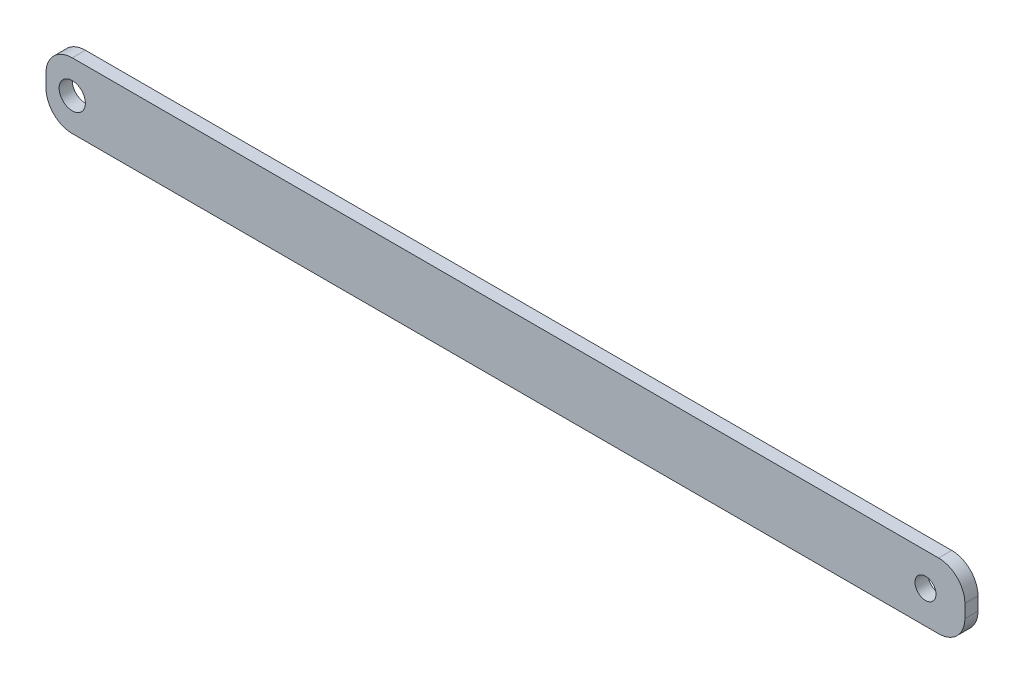
ISO-10303-21;
HEADER;
FILE_DESCRIPTION(('STEP AP214'),'2;1');
FILE_NAME('part.step','',(''),(''),'','','');
FILE_SCHEMA(('AUTOMOTIVE_DESIGN { 1 0 10303 214 1 1 1 1 }'));
ENDSEC;
DATA;
#1=APPLICATION_CONTEXT('core data for automotive mechanical design processes');
#2=APPLICATION_PROTOCOL_DEFINITION('international standard','automotive_design',2000,#1);
#3=PRODUCT_CONTEXT('',#1,'mechanical');
#4=PRODUCT('Part','Part','',(#3));
#5=PRODUCT_RELATED_PRODUCT_CATEGORY('part','',(#4));
#6=PRODUCT_DEFINITION_FORMATION('','',#4);
#7=PRODUCT_DEFINITION_CONTEXT('part definition',#1,'design');
#8=PRODUCT_DEFINITION('design','',#6,#7);
#9=PRODUCT_DEFINITION_SHAPE('','',#8);
#10=(LENGTH_UNIT() NAMED_UNIT(*) SI_UNIT(.MILLI.,.METRE.));
#11=(NAMED_UNIT(*) PLANE_ANGLE_UNIT() SI_UNIT($,.RADIAN.));
#12=(NAMED_UNIT(*) SI_UNIT($,.STERADIAN.) SOLID_ANGLE_UNIT());
#13=UNCERTAINTY_MEASURE_WITH_UNIT(LENGTH_MEASURE(1.E-05),#10,'distance_accuracy_value','');
#14=(GEOMETRIC_REPRESENTATION_CONTEXT(3) GLOBAL_UNCERTAINTY_ASSIGNED_CONTEXT((#13)) GLOBAL_UNIT_ASSIGNED_CONTEXT((#10,
#11,#12)) REPRESENTATION_CONTEXT('',''));
#15=CARTESIAN_POINT('',(0.,0.,0.));
#16=DIRECTION('',(0.,0.,1.));
#17=DIRECTION('',(1.,0.,0.));
#18=AXIS2_PLACEMENT_3D('',#15,#16,#17);
#19=CARTESIAN_POINT('',(15.,-12.5,2.5));
#20=DIRECTION('',(-1.,0.,0.));
#21=DIRECTION('',(0.,1.,0.));
#22=AXIS2_PLACEMENT_3D('',#19,#20,#21);
#23=PLANE('',#22);
#24=DIRECTION('',(0.,0.,1.));
#25=VECTOR('',#24,1.);
#26=CARTESIAN_POINT('',(15.,-2.5,2.5));
#27=LINE('',#26,#25);
#28=CARTESIAN_POINT('',(15.,-2.5,-2.5));
#29=VERTEX_POINT('',#28);
#30=CARTESIAN_POINT('',(15.,-2.5,2.5));
#31=VERTEX_POINT('',#30);
#32=EDGE_CURVE('E11',#29,#31,#27,.T.);
#33=ORIENTED_EDGE('',*,*,#32,.F.);
#34=DIRECTION('',(0.,1.,0.));
#35=VECTOR('',#34,1.);
#36=CARTESIAN_POINT('',(15.,-12.5,-2.5));
#37=LINE('',#36,#35);
#38=CARTESIAN_POINT('',(15.,2.5,-2.5));
#39=VERTEX_POINT('',#38);
#40=EDGE_CURVE('E103',#29,#39,#37,.T.);
#41=ORIENTED_EDGE('',*,*,#40,.T.);
#42=DIRECTION('',(0.,0.,1.));
#43=VECTOR('',#42,1.);
#44=CARTESIAN_POINT('',(15.,2.5,2.5));
#45=LINE('',#44,#43);
#46=CARTESIAN_POINT('',(15.,2.5,2.5));
#47=VERTEX_POINT('',#46);
#48=EDGE_CURVE('E46',#39,#47,#45,.T.);
#49=ORIENTED_EDGE('',*,*,#48,.T.);
#50=DIRECTION('',(0.,1.,0.));
#51=VECTOR('',#50,1.);
#52=CARTESIAN_POINT('',(15.,-12.5,2.5));
#53=LINE('',#52,#51);
#54=EDGE_CURVE('E145',#31,#47,#53,.T.);
#55=ORIENTED_EDGE('',*,*,#54,.F.);
#56=EDGE_LOOP('',(#33,#41,#49,#55));
#57=FACE_BOUND('',#56,.T.);
#58=ADVANCED_FACE('F36',(#57),#23,.F.);
#59=CARTESIAN_POINT('',(5.,2.5,2.5));
#60=DIRECTION('',(0.,0.,-1.));
#61=DIRECTION('',(-1.,0.,0.));
#62=AXIS2_PLACEMENT_3D('',#59,#60,#61);
#63=CYLINDRICAL_SURFACE('',#62,10.);
#64=ORIENTED_EDGE('',*,*,#48,.F.);
#65=CARTESIAN_POINT('',(5.,2.5,-2.5));
#66=DIRECTION('',(0.,0.,-1.));
#67=DIRECTION('',(-1.,0.,0.));
#68=AXIS2_PLACEMENT_3D('',#65,#66,#67);
#69=CIRCLE('',#68,10.);
#70=CARTESIAN_POINT('',(5.,12.5,-2.5));
#71=VERTEX_POINT('',#70);
#72=EDGE_CURVE('E125',#39,#71,#69,.F.);
#73=ORIENTED_EDGE('',*,*,#72,.T.);
#74=DIRECTION('',(0.,0.,1.));
#75=VECTOR('',#74,1.);
#76=CARTESIAN_POINT('',(5.,12.5,2.5));
#77=LINE('',#76,#75);
#78=CARTESIAN_POINT('',(5.,12.5,2.5));
#79=VERTEX_POINT('',#78);
#80=EDGE_CURVE('E138',#71,#79,#77,.T.);
#81=ORIENTED_EDGE('',*,*,#80,.T.);
#82=CARTESIAN_POINT('',(5.,2.5,2.5));
#83=DIRECTION('',(0.,0.,-1.));
#84=DIRECTION('',(-1.,0.,0.));
#85=AXIS2_PLACEMENT_3D('',#82,#83,#84);
#86=CIRCLE('',#85,10.);
#87=EDGE_CURVE('E154',#47,#79,#86,.F.);
#88=ORIENTED_EDGE('',*,*,#87,.F.);
#89=EDGE_LOOP('',(#64,#73,#81,#88));
#90=FACE_BOUND('',#89,.T.);
#91=ADVANCED_FACE('F157',(#90),#63,.T.);
#92=CARTESIAN_POINT('',(-335.,12.5,2.50000000000004));
#93=DIRECTION('',(0.,1.,0.));
#94=DIRECTION('',(1.,0.,0.));
#95=AXIS2_PLACEMENT_3D('',#92,#93,#94);
#96=PLANE('',#95);
#97=ORIENTED_EDGE('',*,*,#80,.F.);
#98=DIRECTION('',(-1.,0.,0.));
#99=VECTOR('',#98,1.);
#100=CARTESIAN_POINT('',(-335.,12.5,-2.49999999999996));
#101=LINE('',#100,#99);
#102=CARTESIAN_POINT('',(-325.,12.5,-2.49999999999996));
#103=VERTEX_POINT('',#102);
#104=EDGE_CURVE('E122',#103,#71,#101,.F.);
#105=ORIENTED_EDGE('',*,*,#104,.F.);
#106=DIRECTION('',(0.,0.,1.));
#107=VECTOR('',#106,1.);
#108=CARTESIAN_POINT('',(-325.,12.5,2.50000000000004));
#109=LINE('',#108,#107);
#110=CARTESIAN_POINT('',(-325.,12.5,2.50000000000004));
#111=VERTEX_POINT('',#110);
#112=EDGE_CURVE('E135',#103,#111,#109,.T.);
#113=ORIENTED_EDGE('',*,*,#112,.T.);
#114=DIRECTION('',(1.,0.,0.));
#115=VECTOR('',#114,1.);
#116=CARTESIAN_POINT('',(-335.,12.5,2.50000000000004));
#117=LINE('',#116,#115);
#118=EDGE_CURVE('E158',#111,#79,#117,.T.);
#119=ORIENTED_EDGE('',*,*,#118,.T.);
#120=EDGE_LOOP('',(#97,#105,#113,#119));
#121=FACE_BOUND('',#120,.T.);
#122=ADVANCED_FACE('F196',(#121),#96,.T.);
#123=CARTESIAN_POINT('',(-325.,2.5,2.50000000000004));
#124=DIRECTION('',(0.,0.,-1.));
#125=DIRECTION('',(-1.,0.,0.));
#126=AXIS2_PLACEMENT_3D('',#123,#124,#125);
#127=CYLINDRICAL_SURFACE('',#126,10.);
#128=ORIENTED_EDGE('',*,*,#112,.F.);
#129=CARTESIAN_POINT('',(-325.,2.5,-2.49999999999996));
#130=DIRECTION('',(0.,0.,-1.));
#131=DIRECTION('',(-1.,0.,0.));
#132=AXIS2_PLACEMENT_3D('',#129,#130,#131);
#133=CIRCLE('',#132,10.);
#134=CARTESIAN_POINT('',(-335.,2.5,-2.49999999999996));
#135=VERTEX_POINT('',#134);
#136=EDGE_CURVE('E119',#103,#135,#133,.F.);
#137=ORIENTED_EDGE('',*,*,#136,.T.);
#138=DIRECTION('',(0.,0.,1.));
#139=VECTOR('',#138,1.);
#140=CARTESIAN_POINT('',(-335.,2.5,2.50000000000004));
#141=LINE('',#140,#139);
#142=CARTESIAN_POINT('',(-335.,2.5,2.50000000000004));
#143=VERTEX_POINT('',#142);
#144=EDGE_CURVE('E132',#135,#143,#141,.T.);
#145=ORIENTED_EDGE('',*,*,#144,.T.);
#146=CARTESIAN_POINT('',(-325.,2.5,2.50000000000004));
#147=DIRECTION('',(0.,0.,-1.));
#148=DIRECTION('',(-1.,0.,0.));
#149=AXIS2_PLACEMENT_3D('',#146,#147,#148);
#150=CIRCLE('',#149,10.);
#151=EDGE_CURVE('E160',#111,#143,#150,.F.);
#152=ORIENTED_EDGE('',*,*,#151,.F.);
#153=EDGE_LOOP('',(#128,#137,#145,#152));
#154=FACE_BOUND('',#153,.T.);
#155=ADVANCED_FACE('F201',(#154),#127,.T.);
#156=CARTESIAN_POINT('',(-335.,-12.5,2.50000000000004));
#157=DIRECTION('',(-1.,0.,0.));
#158=DIRECTION('',(0.,1.,0.));
#159=AXIS2_PLACEMENT_3D('',#156,#157,#158);
#160=PLANE('',#159);
#161=ORIENTED_EDGE('',*,*,#144,.F.);
#162=DIRECTION('',(0.,1.,0.));
#163=VECTOR('',#162,1.);
#164=CARTESIAN_POINT('',(-335.,-12.5,-2.49999999999996));
#165=LINE('',#164,#163);
#166=CARTESIAN_POINT('',(-335.,-2.5,-2.49999999999996));
#167=VERTEX_POINT('',#166);
#168=EDGE_CURVE('E116',#167,#135,#165,.T.);
#169=ORIENTED_EDGE('',*,*,#168,.F.);
#170=DIRECTION('',(0.,0.,1.));
#171=VECTOR('',#170,1.);
#172=CARTESIAN_POINT('',(-335.,-2.5,2.50000000000004));
#173=LINE('',#172,#171);
#174=CARTESIAN_POINT('',(-335.,-2.5,2.50000000000004));
#175=VERTEX_POINT('',#174);
#176=EDGE_CURVE('E130',#167,#175,#173,.T.);
#177=ORIENTED_EDGE('',*,*,#176,.T.);
#178=DIRECTION('',(0.,1.,0.));
#179=VECTOR('',#178,1.);
#180=CARTESIAN_POINT('',(-335.,-12.5,2.50000000000004));
#181=LINE('',#180,#179);
#182=EDGE_CURVE('E166',#175,#143,#181,.T.);
#183=ORIENTED_EDGE('',*,*,#182,.T.);
#184=EDGE_LOOP('',(#161,#169,#177,#183));
#185=FACE_BOUND('',#184,.T.);
#186=ADVANCED_FACE('F205',(#185),#160,.T.);
#187=CARTESIAN_POINT('',(-325.,-2.5,2.50000000000004));
#188=DIRECTION('',(0.,0.,-1.));
#189=DIRECTION('',(-1.,0.,0.));
#190=AXIS2_PLACEMENT_3D('',#187,#188,#189);
#191=CYLINDRICAL_SURFACE('',#190,10.);
#192=ORIENTED_EDGE('',*,*,#176,.F.);
#193=CARTESIAN_POINT('',(-325.,-2.5,-2.49999999999996));
#194=DIRECTION('',(0.,0.,-1.));
#195=DIRECTION('',(-1.,0.,0.));
#196=AXIS2_PLACEMENT_3D('',#193,#194,#195);
#197=CIRCLE('',#196,10.);
#198=CARTESIAN_POINT('',(-325.,-12.5,-2.49999999999996));
#199=VERTEX_POINT('',#198);
#200=EDGE_CURVE('E113',#167,#199,#197,.F.);
#201=ORIENTED_EDGE('',*,*,#200,.T.);
#202=DIRECTION('',(0.,0.,1.));
#203=VECTOR('',#202,1.);
#204=CARTESIAN_POINT('',(-325.,-12.5,2.50000000000004));
#205=LINE('',#204,#203);
#206=CARTESIAN_POINT('',(-325.,-12.5,2.50000000000004));
#207=VERTEX_POINT('',#206);
#208=EDGE_CURVE('E54',#199,#207,#205,.T.);
#209=ORIENTED_EDGE('',*,*,#208,.T.);
#210=CARTESIAN_POINT('',(-325.,-2.5,2.50000000000004));
#211=DIRECTION('',(0.,0.,-1.));
#212=DIRECTION('',(-1.,0.,0.));
#213=AXIS2_PLACEMENT_3D('',#210,#211,#212);
#214=CIRCLE('',#213,10.);
#215=EDGE_CURVE('E96',#175,#207,#214,.F.);
#216=ORIENTED_EDGE('',*,*,#215,.F.);
#217=EDGE_LOOP('',(#192,#201,#209,#216));
#218=FACE_BOUND('',#217,.T.);
#219=ADVANCED_FACE('F209',(#218),#191,.T.);
#220=CARTESIAN_POINT('',(-335.,-12.5,2.50000000000004));
#221=DIRECTION('',(0.,1.,0.));
#222=DIRECTION('',(1.,0.,0.));
#223=AXIS2_PLACEMENT_3D('',#220,#221,#222);
#224=PLANE('',#223);
#225=ORIENTED_EDGE('',*,*,#208,.F.);
#226=DIRECTION('',(-1.,0.,0.));
#227=VECTOR('',#226,1.);
#228=CARTESIAN_POINT('',(-335.,-12.5,-2.49999999999996));
#229=LINE('',#228,#227);
#230=CARTESIAN_POINT('',(5.,-12.5,-2.5));
#231=VERTEX_POINT('',#230);
#232=EDGE_CURVE('E101',#199,#231,#229,.F.);
#233=ORIENTED_EDGE('',*,*,#232,.T.);
#234=DIRECTION('',(0.,0.,1.));
#235=VECTOR('',#234,1.);
#236=CARTESIAN_POINT('',(5.,-12.5,2.5));
#237=LINE('',#236,#235);
#238=CARTESIAN_POINT('',(5.,-12.5,2.5));
#239=VERTEX_POINT('',#238);
#240=EDGE_CURVE('E40',#231,#239,#237,.T.);
#241=ORIENTED_EDGE('',*,*,#240,.T.);
#242=DIRECTION('',(1.,0.,0.));
#243=VECTOR('',#242,1.);
#244=CARTESIAN_POINT('',(-335.,-12.5,2.50000000000004));
#245=LINE('',#244,#243);
#246=EDGE_CURVE('E343',#207,#239,#245,.T.);
#247=ORIENTED_EDGE('',*,*,#246,.F.);
#248=EDGE_LOOP('',(#225,#233,#241,#247));
#249=FACE_BOUND('',#248,.T.);
#250=ADVANCED_FACE('F105',(#249),#224,.F.);
#251=CARTESIAN_POINT('',(-325.,0.,2.50000000000004));
#252=DIRECTION('',(0.,0.,-1.));
#253=DIRECTION('',(-1.,0.,0.));
#254=AXIS2_PLACEMENT_3D('',#251,#252,#253);
#255=CYLINDRICAL_SURFACE('',#254,4.99999999999999);
#256=CARTESIAN_POINT('',(-325.,0.,2.50000000000004));
#257=DIRECTION('',(0.,0.,-1.));
#258=DIRECTION('',(-1.,0.,0.));
#259=AXIS2_PLACEMENT_3D('',#256,#257,#258);
#260=CIRCLE('',#259,4.99999999999999);
#261=CARTESIAN_POINT('',(-330.,0.,2.50000000000004));
#262=VERTEX_POINT('',#261);
#263=EDGE_CURVE('E115',#262,#262,#260,.T.);
#264=ORIENTED_EDGE('',*,*,#263,.F.);
#265=EDGE_LOOP('',(#264));
#266=FACE_BOUND('',#265,.T.);
#267=CARTESIAN_POINT('',(-325.,0.,-2.49999999999996));
#268=DIRECTION('',(0.,0.,-1.));
#269=DIRECTION('',(-1.,0.,0.));
#270=AXIS2_PLACEMENT_3D('',#267,#268,#269);
#271=CIRCLE('',#270,4.99999999999999);
#272=CARTESIAN_POINT('',(-330.,0.,-2.49999999999996));
#273=VERTEX_POINT('',#272);
#274=EDGE_CURVE('E109',#273,#273,#271,.T.);
#275=ORIENTED_EDGE('',*,*,#274,.T.);
#276=EDGE_LOOP('',(#275));
#277=FACE_BOUND('',#276,.T.);
#278=ADVANCED_FACE('F173',(#266,#277),#255,.F.);
#279=CARTESIAN_POINT('',(0.,0.,2.5));
#280=DIRECTION('',(0.,0.,-1.));
#281=DIRECTION('',(-1.,0.,0.));
#282=AXIS2_PLACEMENT_3D('',#279,#280,#281);
#283=CYLINDRICAL_SURFACE('',#282,4.);
#284=CARTESIAN_POINT('',(0.,0.,2.5));
#285=DIRECTION('',(0.,0.,1.));
#286=DIRECTION('',(1.,0.,0.));
#287=AXIS2_PLACEMENT_3D('',#284,#285,#286);
#288=CIRCLE('',#287,4.);
#289=CARTESIAN_POINT('',(4.,0.,2.5));
#290=VERTEX_POINT('',#289);
#291=EDGE_CURVE('E342',#290,#290,#288,.T.);
#292=ORIENTED_EDGE('',*,*,#291,.T.);
#293=EDGE_LOOP('',(#292));
#294=FACE_BOUND('',#293,.T.);
#295=CARTESIAN_POINT('',(0.,0.,-2.5));
#296=DIRECTION('',(0.,0.,1.));
#297=DIRECTION('',(1.,0.,0.));
#298=AXIS2_PLACEMENT_3D('',#295,#296,#297);
#299=CIRCLE('',#298,4.);
#300=CARTESIAN_POINT('',(4.,0.,-2.5));
#301=VERTEX_POINT('',#300);
#302=EDGE_CURVE('E106',#301,#301,#299,.T.);
#303=ORIENTED_EDGE('',*,*,#302,.F.);
#304=EDGE_LOOP('',(#303));
#305=FACE_BOUND('',#304,.T.);
#306=ADVANCED_FACE('F180',(#294,#305),#283,.F.);
#307=CARTESIAN_POINT('',(5.,-2.5,2.5));
#308=DIRECTION('',(0.,0.,-1.));
#309=DIRECTION('',(-1.,0.,0.));
#310=AXIS2_PLACEMENT_3D('',#307,#308,#309);
#311=CYLINDRICAL_SURFACE('',#310,10.);
#312=CARTESIAN_POINT('',(5.,-2.5,-2.5));
#313=DIRECTION('',(0.,0.,-1.));
#314=DIRECTION('',(-1.,0.,0.));
#315=AXIS2_PLACEMENT_3D('',#312,#313,#314);
#316=CIRCLE('',#315,10.);
#317=EDGE_CURVE('E90',#231,#29,#316,.F.);
#318=ORIENTED_EDGE('',*,*,#317,.T.);
#319=ORIENTED_EDGE('',*,*,#32,.T.);
#320=CARTESIAN_POINT('',(5.,-2.5,2.5));
#321=DIRECTION('',(0.,0.,-1.));
#322=DIRECTION('',(-1.,0.,0.));
#323=AXIS2_PLACEMENT_3D('',#320,#321,#322);
#324=CIRCLE('',#323,10.);
#325=EDGE_CURVE('E92',#239,#31,#324,.F.);
#326=ORIENTED_EDGE('',*,*,#325,.F.);
#327=ORIENTED_EDGE('',*,*,#240,.F.);
#328=EDGE_LOOP('',(#318,#319,#326,#327));
#329=FACE_BOUND('',#328,.T.);
#330=ADVANCED_FACE('F38',(#329),#311,.T.);
#331=CARTESIAN_POINT('',(-335.,-12.5,2.50000000000004));
#332=DIRECTION('',(0.,0.,-1.));
#333=DIRECTION('',(-1.,0.,0.));
#334=AXIS2_PLACEMENT_3D('',#331,#332,#333);
#335=PLANE('',#334);
#336=ORIENTED_EDGE('',*,*,#263,.T.);
#337=EDGE_LOOP('',(#336));
#338=FACE_BOUND('',#337,.T.);
#339=ORIENTED_EDGE('',*,*,#291,.F.);
#340=EDGE_LOOP('',(#339));
#341=FACE_BOUND('',#340,.T.);
#342=ORIENTED_EDGE('',*,*,#246,.T.);
#343=ORIENTED_EDGE('',*,*,#325,.T.);
#344=ORIENTED_EDGE('',*,*,#54,.T.);
#345=ORIENTED_EDGE('',*,*,#87,.T.);
#346=ORIENTED_EDGE('',*,*,#118,.F.);
#347=ORIENTED_EDGE('',*,*,#151,.T.);
#348=ORIENTED_EDGE('',*,*,#182,.F.);
#349=ORIENTED_EDGE('',*,*,#215,.T.);
#350=EDGE_LOOP('',(#342,#343,#344,#345,#346,#347,#348,#349));
#351=FACE_BOUND('',#350,.T.);
#352=ADVANCED_FACE('F152',(#338,#341,#351),#335,.F.);
#353=CARTESIAN_POINT('',(-335.,-12.5,-2.49999999999996));
#354=DIRECTION('',(0.,0.,-1.));
#355=DIRECTION('',(-1.,0.,0.));
#356=AXIS2_PLACEMENT_3D('',#353,#354,#355);
#357=PLANE('',#356);
#358=ORIENTED_EDGE('',*,*,#274,.F.);
#359=EDGE_LOOP('',(#358));
#360=FACE_BOUND('',#359,.T.);
#361=ORIENTED_EDGE('',*,*,#302,.T.);
#362=EDGE_LOOP('',(#361));
#363=FACE_BOUND('',#362,.T.);
#364=ORIENTED_EDGE('',*,*,#232,.F.);
#365=ORIENTED_EDGE('',*,*,#200,.F.);
#366=ORIENTED_EDGE('',*,*,#168,.T.);
#367=ORIENTED_EDGE('',*,*,#136,.F.);
#368=ORIENTED_EDGE('',*,*,#104,.T.);
#369=ORIENTED_EDGE('',*,*,#72,.F.);
#370=ORIENTED_EDGE('',*,*,#40,.F.);
#371=ORIENTED_EDGE('',*,*,#317,.F.);
#372=EDGE_LOOP('',(#364,#365,#366,#367,#368,#369,#370,#371));
#373=FACE_BOUND('',#372,.T.);
#374=ADVANCED_FACE('F99',(#360,#363,#373),#357,.T.);
#375=CLOSED_SHELL('',(#58,#91,#122,#155,#186,#219,#250,#278,#306,#330,#352,#374));
#376=MANIFOLD_SOLID_BREP('B2',#375);
#377=ADVANCED_BREP_SHAPE_REPRESENTATION('',(#18,#376),#14);
#378=SHAPE_DEFINITION_REPRESENTATION(#9,#377);
ENDSEC;
END-ISO-10303-21;
